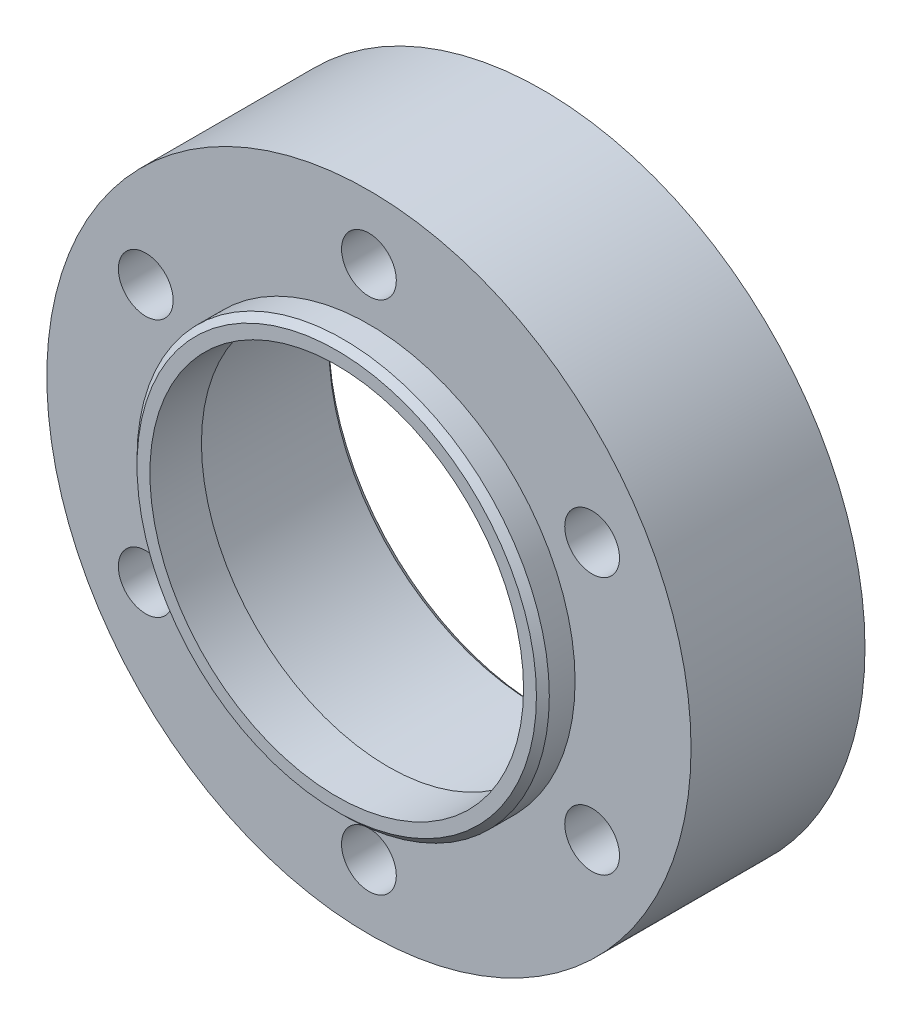
ISO-10303-21;
HEADER;
FILE_DESCRIPTION(('STEP AP214'),'2;1');
FILE_NAME('part.step','',(''),(''),'','','');
FILE_SCHEMA(('AUTOMOTIVE_DESIGN { 1 0 10303 214 1 1 1 1 }'));
ENDSEC;
DATA;
#1=APPLICATION_CONTEXT('core data for automotive mechanical design processes');
#2=APPLICATION_PROTOCOL_DEFINITION('international standard','automotive_design',2000,#1);
#3=PRODUCT_CONTEXT('',#1,'mechanical');
#4=PRODUCT('Part','Part','',(#3));
#5=PRODUCT_RELATED_PRODUCT_CATEGORY('part','',(#4));
#6=PRODUCT_DEFINITION_FORMATION('','',#4);
#7=PRODUCT_DEFINITION_CONTEXT('part definition',#1,'design');
#8=PRODUCT_DEFINITION('design','',#6,#7);
#9=PRODUCT_DEFINITION_SHAPE('','',#8);
#10=(LENGTH_UNIT() NAMED_UNIT(*) SI_UNIT(.MILLI.,.METRE.));
#11=(NAMED_UNIT(*) PLANE_ANGLE_UNIT() SI_UNIT($,.RADIAN.));
#12=(NAMED_UNIT(*) SI_UNIT($,.STERADIAN.) SOLID_ANGLE_UNIT());
#13=UNCERTAINTY_MEASURE_WITH_UNIT(LENGTH_MEASURE(1.E-05),#10,'distance_accuracy_value','');
#14=(GEOMETRIC_REPRESENTATION_CONTEXT(3) GLOBAL_UNCERTAINTY_ASSIGNED_CONTEXT((#13)) GLOBAL_UNIT_ASSIGNED_CONTEXT((#10,
#11,#12)) REPRESENTATION_CONTEXT('',''));
#15=CARTESIAN_POINT('',(0.,0.,0.));
#16=DIRECTION('',(0.,0.,1.));
#17=DIRECTION('',(1.,0.,0.));
#18=AXIS2_PLACEMENT_3D('',#15,#16,#17);
#19=CARTESIAN_POINT('',(0.,0.,27.));
#20=DIRECTION('',(0.,0.,-1.));
#21=DIRECTION('',(-1.,0.,0.));
#22=AXIS2_PLACEMENT_3D('',#19,#20,#21);
#23=CYLINDRICAL_SURFACE('',#22,50.);
#24=CARTESIAN_POINT('',(0.,0.,27.));
#25=DIRECTION('',(0.,0.,1.));
#26=DIRECTION('',(1.,0.,0.));
#27=AXIS2_PLACEMENT_3D('',#24,#25,#26);
#28=CIRCLE('',#27,50.);
#29=CARTESIAN_POINT('',(50.,0.,27.));
#30=VERTEX_POINT('',#29);
#31=EDGE_CURVE('E58',#30,#30,#28,.T.);
#32=ORIENTED_EDGE('',*,*,#31,.F.);
#33=EDGE_LOOP('',(#32));
#34=FACE_BOUND('',#33,.T.);
#35=CARTESIAN_POINT('',(0.,0.,0.));
#36=DIRECTION('',(0.,0.,1.));
#37=DIRECTION('',(1.,0.,0.));
#38=AXIS2_PLACEMENT_3D('',#35,#36,#37);
#39=CIRCLE('',#38,50.);
#40=CARTESIAN_POINT('',(50.,0.,0.));
#41=VERTEX_POINT('',#40);
#42=EDGE_CURVE('E55',#41,#41,#39,.T.);
#43=ORIENTED_EDGE('',*,*,#42,.T.);
#44=EDGE_LOOP('',(#43));
#45=FACE_BOUND('',#44,.T.);
#46=ADVANCED_FACE('F33',(#34,#45),#23,.T.);
#47=CARTESIAN_POINT('',(0.,0.,27.));
#48=DIRECTION('',(0.,0.,1.));
#49=DIRECTION('',(1.,0.,0.));
#50=AXIS2_PLACEMENT_3D('',#47,#48,#49);
#51=PLANE('',#50);
#52=CARTESIAN_POINT('',(0.,40.,27.));
#53=DIRECTION('',(0.,0.,1.));
#54=DIRECTION('',(1.,0.,0.));
#55=AXIS2_PLACEMENT_3D('',#52,#53,#54);
#56=CIRCLE('',#55,4.25);
#57=CARTESIAN_POINT('',(4.25,40.,27.));
#58=VERTEX_POINT('',#57);
#59=EDGE_CURVE('E72',#58,#58,#56,.T.);
#60=ORIENTED_EDGE('',*,*,#59,.F.);
#61=EDGE_LOOP('',(#60));
#62=FACE_BOUND('',#61,.T.);
#63=CARTESIAN_POINT('',(34.6410161513767,19.9999999999985,27.));
#64=DIRECTION('',(0.,0.,1.));
#65=DIRECTION('',(1.,0.,0.));
#66=AXIS2_PLACEMENT_3D('',#63,#64,#65);
#67=CIRCLE('',#66,4.25000000000173);
#68=CARTESIAN_POINT('',(38.8910161513784,19.9999999999985,27.));
#69=VERTEX_POINT('',#68);
#70=EDGE_CURVE('E75',#69,#69,#67,.T.);
#71=ORIENTED_EDGE('',*,*,#70,.F.);
#72=EDGE_LOOP('',(#71));
#73=FACE_BOUND('',#72,.T.);
#74=CARTESIAN_POINT('',(34.641016151375,-20.0000000000015,27.));
#75=DIRECTION('',(0.,0.,1.));
#76=DIRECTION('',(1.,0.,0.));
#77=AXIS2_PLACEMENT_3D('',#74,#75,#76);
#78=CIRCLE('',#77,4.25000000000323);
#79=CARTESIAN_POINT('',(38.8910161513782,-20.0000000000015,27.));
#80=VERTEX_POINT('',#79);
#81=EDGE_CURVE('E78',#80,#80,#78,.T.);
#82=ORIENTED_EDGE('',*,*,#81,.F.);
#83=EDGE_LOOP('',(#82));
#84=FACE_BOUND('',#83,.T.);
#85=CARTESIAN_POINT('',(-3.39590937005871E-12,-40.,27.));
#86=DIRECTION('',(0.,0.,1.));
#87=DIRECTION('',(1.,0.,0.));
#88=AXIS2_PLACEMENT_3D('',#85,#86,#87);
#89=CIRCLE('',#88,4.25000000000352);
#90=CARTESIAN_POINT('',(4.25000000000012,-40.,27.));
#91=VERTEX_POINT('',#90);
#92=EDGE_CURVE('E81',#91,#91,#89,.T.);
#93=ORIENTED_EDGE('',*,*,#92,.F.);
#94=EDGE_LOOP('',(#93));
#95=FACE_BOUND('',#94,.T.);
#96=CARTESIAN_POINT('',(-34.6410161513801,-19.9999999999985,27.));
#97=DIRECTION('',(0.,0.,1.));
#98=DIRECTION('',(1.,0.,0.));
#99=AXIS2_PLACEMENT_3D('',#96,#97,#98);
#100=CIRCLE('',#99,4.25000000000219);
#101=CARTESIAN_POINT('',(-30.3910161513779,-19.9999999999985,27.));
#102=VERTEX_POINT('',#101);
#103=EDGE_CURVE('E84',#102,#102,#100,.T.);
#104=ORIENTED_EDGE('',*,*,#103,.F.);
#105=EDGE_LOOP('',(#104));
#106=FACE_BOUND('',#105,.T.);
#107=CARTESIAN_POINT('',(-34.6410161513784,20.0000000000015,27.));
#108=DIRECTION('',(0.,0.,1.));
#109=DIRECTION('',(1.,0.,0.));
#110=AXIS2_PLACEMENT_3D('',#107,#108,#109);
#111=CIRCLE('',#110,4.25000000000048);
#112=CARTESIAN_POINT('',(-30.3910161513779,20.0000000000015,27.));
#113=VERTEX_POINT('',#112);
#114=EDGE_CURVE('E87',#113,#113,#111,.T.);
#115=ORIENTED_EDGE('',*,*,#114,.F.);
#116=EDGE_LOOP('',(#115));
#117=FACE_BOUND('',#116,.T.);
#118=CARTESIAN_POINT('',(0.,0.,27.));
#119=DIRECTION('',(0.,0.,1.));
#120=DIRECTION('',(1.,0.,0.));
#121=AXIS2_PLACEMENT_3D('',#118,#119,#120);
#122=CIRCLE('',#121,32.);
#123=CARTESIAN_POINT('',(32.,0.,27.));
#124=VERTEX_POINT('',#123);
#125=EDGE_CURVE('E54',#124,#124,#122,.T.);
#126=ORIENTED_EDGE('',*,*,#125,.F.);
#127=EDGE_LOOP('',(#126));
#128=FACE_BOUND('',#127,.T.);
#129=ORIENTED_EDGE('',*,*,#31,.T.);
#130=EDGE_LOOP('',(#129));
#131=FACE_BOUND('',#130,.T.);
#132=ADVANCED_FACE('F115',(#62,#73,#84,#95,#106,#117,#128,#131),#51,.T.);
#133=CARTESIAN_POINT('',(0.,0.,0.));
#134=DIRECTION('',(0.,0.,1.));
#135=DIRECTION('',(1.,0.,0.));
#136=AXIS2_PLACEMENT_3D('',#133,#134,#135);
#137=PLANE('',#136);
#138=CARTESIAN_POINT('',(0.,0.,0.));
#139=DIRECTION('',(0.,0.,1.));
#140=DIRECTION('',(1.,0.,0.));
#141=AXIS2_PLACEMENT_3D('',#138,#139,#140);
#142=CIRCLE('',#141,33.2);
#143=CARTESIAN_POINT('',(33.2,0.,0.));
#144=VERTEX_POINT('',#143);
#145=EDGE_CURVE('E45',#144,#144,#142,.T.);
#146=ORIENTED_EDGE('',*,*,#145,.T.);
#147=EDGE_LOOP('',(#146));
#148=FACE_BOUND('',#147,.T.);
#149=CARTESIAN_POINT('',(0.,40.,0.));
#150=DIRECTION('',(0.,0.,-1.));
#151=DIRECTION('',(-1.,0.,0.));
#152=AXIS2_PLACEMENT_3D('',#149,#150,#151);
#153=CIRCLE('',#152,4.25);
#154=CARTESIAN_POINT('',(-4.25,40.,0.));
#155=VERTEX_POINT('',#154);
#156=EDGE_CURVE('E90',#155,#155,#153,.T.);
#157=ORIENTED_EDGE('',*,*,#156,.F.);
#158=EDGE_LOOP('',(#157));
#159=FACE_BOUND('',#158,.T.);
#160=CARTESIAN_POINT('',(34.6410161513767,19.9999999999985,0.));
#161=DIRECTION('',(0.,0.,-1.));
#162=DIRECTION('',(-1.,0.,0.));
#163=AXIS2_PLACEMENT_3D('',#160,#161,#162);
#164=CIRCLE('',#163,4.25000000000173);
#165=CARTESIAN_POINT('',(30.391016151375,19.9999999999985,0.));
#166=VERTEX_POINT('',#165);
#167=EDGE_CURVE('E95',#166,#166,#164,.T.);
#168=ORIENTED_EDGE('',*,*,#167,.F.);
#169=EDGE_LOOP('',(#168));
#170=FACE_BOUND('',#169,.T.);
#171=CARTESIAN_POINT('',(34.641016151375,-20.0000000000015,0.));
#172=DIRECTION('',(0.,0.,-1.));
#173=DIRECTION('',(-1.,0.,0.));
#174=AXIS2_PLACEMENT_3D('',#171,#172,#173);
#175=CIRCLE('',#174,4.25000000000323);
#176=CARTESIAN_POINT('',(30.3910161513718,-20.0000000000015,0.));
#177=VERTEX_POINT('',#176);
#178=EDGE_CURVE('E91',#177,#177,#175,.T.);
#179=ORIENTED_EDGE('',*,*,#178,.F.);
#180=EDGE_LOOP('',(#179));
#181=FACE_BOUND('',#180,.T.);
#182=CARTESIAN_POINT('',(-3.39590937005871E-12,-40.,0.));
#183=DIRECTION('',(0.,0.,-1.));
#184=DIRECTION('',(-1.,0.,0.));
#185=AXIS2_PLACEMENT_3D('',#182,#183,#184);
#186=CIRCLE('',#185,4.25000000000352);
#187=CARTESIAN_POINT('',(-4.25000000000691,-40.,0.));
#188=VERTEX_POINT('',#187);
#189=EDGE_CURVE('E94',#188,#188,#186,.T.);
#190=ORIENTED_EDGE('',*,*,#189,.F.);
#191=EDGE_LOOP('',(#190));
#192=FACE_BOUND('',#191,.T.);
#193=CARTESIAN_POINT('',(-34.6410161513801,-19.9999999999985,0.));
#194=DIRECTION('',(0.,0.,-1.));
#195=DIRECTION('',(-1.,0.,0.));
#196=AXIS2_PLACEMENT_3D('',#193,#194,#195);
#197=CIRCLE('',#196,4.25000000000219);
#198=CARTESIAN_POINT('',(-38.8910161513823,-19.9999999999985,0.));
#199=VERTEX_POINT('',#198);
#200=EDGE_CURVE('E98',#199,#199,#197,.T.);
#201=ORIENTED_EDGE('',*,*,#200,.F.);
#202=EDGE_LOOP('',(#201));
#203=FACE_BOUND('',#202,.T.);
#204=CARTESIAN_POINT('',(-34.6410161513784,20.0000000000015,0.));
#205=DIRECTION('',(0.,0.,-1.));
#206=DIRECTION('',(-1.,0.,0.));
#207=AXIS2_PLACEMENT_3D('',#204,#205,#206);
#208=CIRCLE('',#207,4.25000000000048);
#209=CARTESIAN_POINT('',(-38.8910161513789,20.0000000000015,0.));
#210=VERTEX_POINT('',#209);
#211=EDGE_CURVE('E101',#210,#210,#208,.T.);
#212=ORIENTED_EDGE('',*,*,#211,.F.);
#213=EDGE_LOOP('',(#212));
#214=FACE_BOUND('',#213,.T.);
#215=ORIENTED_EDGE('',*,*,#42,.F.);
#216=EDGE_LOOP('',(#215));
#217=FACE_BOUND('',#216,.T.);
#218=ADVANCED_FACE('F111',(#148,#159,#170,#181,#192,#203,#214,#217),#137,.F.);
#219=CARTESIAN_POINT('',(0.,0.,24.));
#220=DIRECTION('',(0.,0.,-1.));
#221=DIRECTION('',(-1.,0.,0.));
#222=AXIS2_PLACEMENT_3D('',#219,#220,#221);
#223=CYLINDRICAL_SURFACE('',#222,32.2);
#224=CARTESIAN_POINT('',(0.,0.,0.999999999999994));
#225=DIRECTION('',(0.,0.,1.));
#226=DIRECTION('',(1.,0.,0.));
#227=AXIS2_PLACEMENT_3D('',#224,#225,#226);
#228=CIRCLE('',#227,32.2);
#229=CARTESIAN_POINT('',(32.2,0.,0.999999999999994));
#230=VERTEX_POINT('',#229);
#231=EDGE_CURVE('E49',#230,#230,#228,.F.);
#232=ORIENTED_EDGE('',*,*,#231,.T.);
#233=EDGE_LOOP('',(#232));
#234=FACE_BOUND('',#233,.T.);
#235=CARTESIAN_POINT('',(0.,0.,24.));
#236=DIRECTION('',(0.,0.,-1.));
#237=DIRECTION('',(-1.,0.,0.));
#238=AXIS2_PLACEMENT_3D('',#235,#236,#237);
#239=CIRCLE('',#238,32.2);
#240=CARTESIAN_POINT('',(-32.2,0.,24.));
#241=VERTEX_POINT('',#240);
#242=EDGE_CURVE('E59',#241,#241,#239,.T.);
#243=ORIENTED_EDGE('',*,*,#242,.F.);
#244=EDGE_LOOP('',(#243));
#245=FACE_BOUND('',#244,.T.);
#246=ADVANCED_FACE('F114',(#234,#245),#223,.F.);
#247=CARTESIAN_POINT('',(0.,0.,24.));
#248=DIRECTION('',(0.,0.,-1.));
#249=DIRECTION('',(-1.,0.,0.));
#250=AXIS2_PLACEMENT_3D('',#247,#248,#249);
#251=PLANE('',#250);
#252=CARTESIAN_POINT('',(0.,0.,24.));
#253=DIRECTION('',(0.,0.,-1.));
#254=DIRECTION('',(-1.,0.,0.));
#255=AXIS2_PLACEMENT_3D('',#252,#253,#254);
#256=CIRCLE('',#255,29.);
#257=CARTESIAN_POINT('',(-29.,0.,24.));
#258=VERTEX_POINT('',#257);
#259=EDGE_CURVE('E64',#258,#258,#256,.T.);
#260=ORIENTED_EDGE('',*,*,#259,.F.);
#261=EDGE_LOOP('',(#260));
#262=FACE_BOUND('',#261,.T.);
#263=ORIENTED_EDGE('',*,*,#242,.T.);
#264=EDGE_LOOP('',(#263));
#265=FACE_BOUND('',#264,.T.);
#266=ADVANCED_FACE('F159',(#262,#265),#251,.T.);
#267=CARTESIAN_POINT('',(0.,0.,32.));
#268=DIRECTION('',(0.,0.,-1.));
#269=DIRECTION('',(-1.,0.,0.));
#270=AXIS2_PLACEMENT_3D('',#267,#268,#269);
#271=CYLINDRICAL_SURFACE('',#270,32.);
#272=CARTESIAN_POINT('',(0.,0.,31.));
#273=DIRECTION('',(0.,0.,1.));
#274=DIRECTION('',(1.,0.,0.));
#275=AXIS2_PLACEMENT_3D('',#272,#273,#274);
#276=CIRCLE('',#275,32.);
#277=CARTESIAN_POINT('',(32.,0.,31.));
#278=VERTEX_POINT('',#277);
#279=EDGE_CURVE('E10',#278,#278,#276,.F.);
#280=ORIENTED_EDGE('',*,*,#279,.T.);
#281=EDGE_LOOP('',(#280));
#282=FACE_BOUND('',#281,.T.);
#283=ORIENTED_EDGE('',*,*,#125,.T.);
#284=EDGE_LOOP('',(#283));
#285=FACE_BOUND('',#284,.T.);
#286=ADVANCED_FACE('F164',(#282,#285),#271,.T.);
#287=CARTESIAN_POINT('',(0.,0.,32.));
#288=DIRECTION('',(0.,0.,1.));
#289=DIRECTION('',(1.,0.,0.));
#290=AXIS2_PLACEMENT_3D('',#287,#288,#289);
#291=PLANE('',#290);
#292=CARTESIAN_POINT('',(0.,0.,32.));
#293=DIRECTION('',(0.,0.,1.));
#294=DIRECTION('',(1.,0.,0.));
#295=AXIS2_PLACEMENT_3D('',#292,#293,#294);
#296=CIRCLE('',#295,31.);
#297=CARTESIAN_POINT('',(31.,0.,32.));
#298=VERTEX_POINT('',#297);
#299=EDGE_CURVE('E41',#298,#298,#296,.T.);
#300=ORIENTED_EDGE('',*,*,#299,.T.);
#301=EDGE_LOOP('',(#300));
#302=FACE_BOUND('',#301,.T.);
#303=CARTESIAN_POINT('',(0.,0.,32.));
#304=DIRECTION('',(0.,0.,1.));
#305=DIRECTION('',(1.,0.,0.));
#306=AXIS2_PLACEMENT_3D('',#303,#304,#305);
#307=CIRCLE('',#306,29.);
#308=CARTESIAN_POINT('',(29.,0.,32.));
#309=VERTEX_POINT('',#308);
#310=EDGE_CURVE('E69',#309,#309,#307,.T.);
#311=ORIENTED_EDGE('',*,*,#310,.F.);
#312=EDGE_LOOP('',(#311));
#313=FACE_BOUND('',#312,.T.);
#314=ADVANCED_FACE('F170',(#302,#313),#291,.T.);
#315=CARTESIAN_POINT('',(0.,0.,0.));
#316=DIRECTION('',(0.,0.,1.));
#317=DIRECTION('',(1.,0.,0.));
#318=AXIS2_PLACEMENT_3D('',#315,#316,#317);
#319=CYLINDRICAL_SURFACE('',#318,29.);
#320=ORIENTED_EDGE('',*,*,#259,.T.);
#321=EDGE_LOOP('',(#320));
#322=FACE_BOUND('',#321,.T.);
#323=ORIENTED_EDGE('',*,*,#310,.T.);
#324=EDGE_LOOP('',(#323));
#325=FACE_BOUND('',#324,.T.);
#326=ADVANCED_FACE('F176',(#322,#325),#319,.F.);
#327=CARTESIAN_POINT('',(-34.6410161513784,20.0000000000015,32.));
#328=DIRECTION('',(0.,0.,-1.));
#329=DIRECTION('',(-1.,0.,0.));
#330=AXIS2_PLACEMENT_3D('',#327,#328,#329);
#331=CYLINDRICAL_SURFACE('',#330,4.25000000000048);
#332=ORIENTED_EDGE('',*,*,#114,.T.);
#333=EDGE_LOOP('',(#332));
#334=FACE_BOUND('',#333,.T.);
#335=ORIENTED_EDGE('',*,*,#211,.T.);
#336=EDGE_LOOP('',(#335));
#337=FACE_BOUND('',#336,.T.);
#338=ADVANCED_FACE('F179',(#334,#337),#331,.F.);
#339=CARTESIAN_POINT('',(-34.6410161513801,-19.9999999999985,32.));
#340=DIRECTION('',(0.,0.,-1.));
#341=DIRECTION('',(-1.,0.,0.));
#342=AXIS2_PLACEMENT_3D('',#339,#340,#341);
#343=CYLINDRICAL_SURFACE('',#342,4.25000000000219);
#344=ORIENTED_EDGE('',*,*,#103,.T.);
#345=EDGE_LOOP('',(#344));
#346=FACE_BOUND('',#345,.T.);
#347=ORIENTED_EDGE('',*,*,#200,.T.);
#348=EDGE_LOOP('',(#347));
#349=FACE_BOUND('',#348,.T.);
#350=ADVANCED_FACE('F188',(#346,#349),#343,.F.);
#351=CARTESIAN_POINT('',(-3.39590937005871E-12,-40.,32.));
#352=DIRECTION('',(0.,0.,-1.));
#353=DIRECTION('',(-1.,0.,0.));
#354=AXIS2_PLACEMENT_3D('',#351,#352,#353);
#355=CYLINDRICAL_SURFACE('',#354,4.25000000000352);
#356=ORIENTED_EDGE('',*,*,#92,.T.);
#357=EDGE_LOOP('',(#356));
#358=FACE_BOUND('',#357,.T.);
#359=ORIENTED_EDGE('',*,*,#189,.T.);
#360=EDGE_LOOP('',(#359));
#361=FACE_BOUND('',#360,.T.);
#362=ADVANCED_FACE('F184',(#358,#361),#355,.F.);
#363=CARTESIAN_POINT('',(34.641016151375,-20.0000000000015,32.));
#364=DIRECTION('',(0.,0.,-1.));
#365=DIRECTION('',(-1.,0.,0.));
#366=AXIS2_PLACEMENT_3D('',#363,#364,#365);
#367=CYLINDRICAL_SURFACE('',#366,4.25000000000323);
#368=ORIENTED_EDGE('',*,*,#81,.T.);
#369=EDGE_LOOP('',(#368));
#370=FACE_BOUND('',#369,.T.);
#371=ORIENTED_EDGE('',*,*,#178,.T.);
#372=EDGE_LOOP('',(#371));
#373=FACE_BOUND('',#372,.T.);
#374=ADVANCED_FACE('F181',(#370,#373),#367,.F.);
#375=CARTESIAN_POINT('',(34.6410161513767,19.9999999999985,32.));
#376=DIRECTION('',(0.,0.,-1.));
#377=DIRECTION('',(-1.,0.,0.));
#378=AXIS2_PLACEMENT_3D('',#375,#376,#377);
#379=CYLINDRICAL_SURFACE('',#378,4.25000000000173);
#380=ORIENTED_EDGE('',*,*,#70,.T.);
#381=EDGE_LOOP('',(#380));
#382=FACE_BOUND('',#381,.T.);
#383=ORIENTED_EDGE('',*,*,#167,.T.);
#384=EDGE_LOOP('',(#383));
#385=FACE_BOUND('',#384,.T.);
#386=ADVANCED_FACE('F150',(#382,#385),#379,.F.);
#387=CARTESIAN_POINT('',(0.,40.,32.));
#388=DIRECTION('',(0.,0.,-1.));
#389=DIRECTION('',(-1.,0.,0.));
#390=AXIS2_PLACEMENT_3D('',#387,#388,#389);
#391=CYLINDRICAL_SURFACE('',#390,4.25);
#392=ORIENTED_EDGE('',*,*,#59,.T.);
#393=EDGE_LOOP('',(#392));
#394=FACE_BOUND('',#393,.T.);
#395=ORIENTED_EDGE('',*,*,#156,.T.);
#396=EDGE_LOOP('',(#395));
#397=FACE_BOUND('',#396,.T.);
#398=ADVANCED_FACE('F109',(#394,#397),#391,.F.);
#399=CARTESIAN_POINT('',(0.,0.,0.999999999999994));
#400=DIRECTION('',(0.,0.,-1.));
#401=DIRECTION('',(-1.,0.,0.));
#402=AXIS2_PLACEMENT_3D('',#399,#400,#401);
#403=CONICAL_SURFACE('',#402,32.2,0.785398163397455);
#404=ORIENTED_EDGE('',*,*,#145,.F.);
#405=EDGE_LOOP('',(#404));
#406=FACE_BOUND('',#405,.T.);
#407=ORIENTED_EDGE('',*,*,#231,.F.);
#408=EDGE_LOOP('',(#407));
#409=FACE_BOUND('',#408,.T.);
#410=ADVANCED_FACE('F140',(#406,#409),#403,.F.);
#411=CARTESIAN_POINT('',(0.,0.,32.));
#412=DIRECTION('',(0.,0.,-1.));
#413=DIRECTION('',(-1.,0.,0.));
#414=AXIS2_PLACEMENT_3D('',#411,#412,#413);
#415=CONICAL_SURFACE('',#414,31.,0.785398163397448);
#416=ORIENTED_EDGE('',*,*,#279,.F.);
#417=EDGE_LOOP('',(#416));
#418=FACE_BOUND('',#417,.T.);
#419=ORIENTED_EDGE('',*,*,#299,.F.);
#420=EDGE_LOOP('',(#419));
#421=FACE_BOUND('',#420,.T.);
#422=ADVANCED_FACE('F36',(#418,#421),#415,.T.);
#423=CLOSED_SHELL('',(#46,#132,#218,#246,#266,#286,#314,#326,#338,#350,#362,#374,#386,#398,#410,#422));
#424=MANIFOLD_SOLID_BREP('B2',#423);
#425=ADVANCED_BREP_SHAPE_REPRESENTATION('',(#18,#424),#14);
#426=SHAPE_DEFINITION_REPRESENTATION(#9,#425);
ENDSEC;
END-ISO-10303-21;
